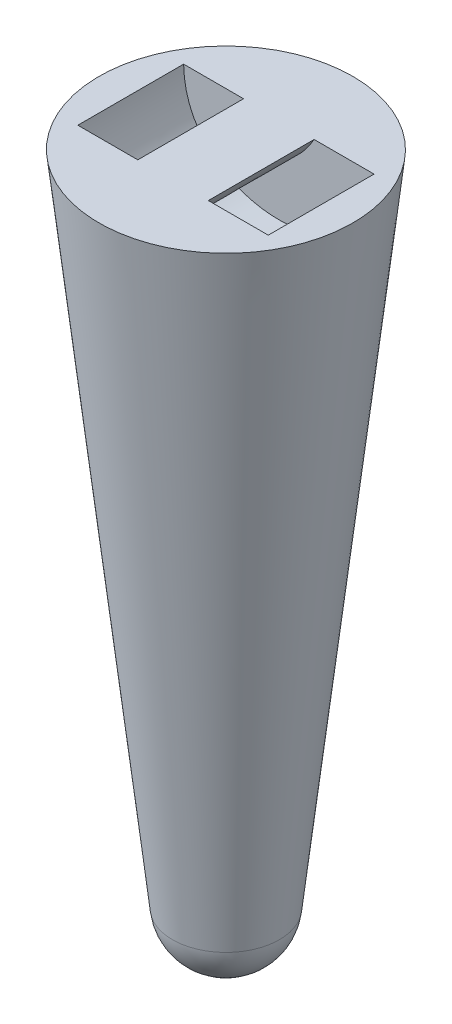
ISO-10303-21;
HEADER;
FILE_DESCRIPTION(('STEP AP214'),'2;1');
FILE_NAME('part.step','',(''),(''),'','','');
FILE_SCHEMA(('AUTOMOTIVE_DESIGN { 1 0 10303 214 1 1 1 1 }'));
ENDSEC;
DATA;
#1=APPLICATION_CONTEXT('core data for automotive mechanical design processes');
#2=APPLICATION_PROTOCOL_DEFINITION('international standard','automotive_design',2000,#1);
#3=PRODUCT_CONTEXT('',#1,'mechanical');
#4=PRODUCT('Part','Part','',(#3));
#5=PRODUCT_RELATED_PRODUCT_CATEGORY('part','',(#4));
#6=PRODUCT_DEFINITION_FORMATION('','',#4);
#7=PRODUCT_DEFINITION_CONTEXT('part definition',#1,'design');
#8=PRODUCT_DEFINITION('design','',#6,#7);
#9=PRODUCT_DEFINITION_SHAPE('','',#8);
#10=(LENGTH_UNIT() NAMED_UNIT(*) SI_UNIT(.MILLI.,.METRE.));
#11=(NAMED_UNIT(*) PLANE_ANGLE_UNIT() SI_UNIT($,.RADIAN.));
#12=(NAMED_UNIT(*) SI_UNIT($,.STERADIAN.) SOLID_ANGLE_UNIT());
#13=UNCERTAINTY_MEASURE_WITH_UNIT(LENGTH_MEASURE(1.E-05),#10,'distance_accuracy_value','');
#14=(GEOMETRIC_REPRESENTATION_CONTEXT(3) GLOBAL_UNCERTAINTY_ASSIGNED_CONTEXT((#13)) GLOBAL_UNIT_ASSIGNED_CONTEXT((#10,
#11,#12)) REPRESENTATION_CONTEXT('',''));
#15=CARTESIAN_POINT('',(0.,0.,0.));
#16=DIRECTION('',(0.,0.,1.));
#17=DIRECTION('',(1.,0.,0.));
#18=AXIS2_PLACEMENT_3D('',#15,#16,#17);
#19=CARTESIAN_POINT('',(-3.55464986802312E-06,107.977844344222,13.5));
#20=DIRECTION('',(0.,0.,-1.));
#21=DIRECTION('',(-1.,0.,0.));
#22=AXIS2_PLACEMENT_3D('',#19,#20,#21);
#23=PLANE('',#22);
#24=DIRECTION('',(-1.,0.,0.));
#25=VECTOR('',#24,1.);
#26=CARTESIAN_POINT('',(-24.3000035546499,130.224662195403,13.5));
#27=LINE('',#26,#25);
#28=CARTESIAN_POINT('',(-9.00000355464987,130.224662195403,13.5));
#29=VERTEX_POINT('',#28);
#30=CARTESIAN_POINT('',(-24.3000035546499,130.224662195403,13.5));
#31=VERTEX_POINT('',#30);
#32=EDGE_CURVE('E90',#29,#31,#27,.T.);
#33=ORIENTED_EDGE('',*,*,#32,.F.);
#34=CARTESIAN_POINT('',(-9.00000355464987,130.224662195403,13.5));
#35=CARTESIAN_POINT('',(-3.55464987085289E-06,114.921508275355,13.5));
#36=CARTESIAN_POINT('',(8.99999644535013,130.224662195403,13.5));
#37=B_SPLINE_CURVE_WITH_KNOTS('',2,(#34,#35,#36),.UNSPECIFIED.,.F.,.F.,(3,3),(0.,1.),.UNSPECIFIED.);
#38=CARTESIAN_POINT('',(8.99999644535013,130.224662195403,13.5));
#39=VERTEX_POINT('',#38);
#40=EDGE_CURVE('E80',#39,#29,#37,.F.);
#41=ORIENTED_EDGE('',*,*,#40,.F.);
#42=CARTESIAN_POINT('',(24.2999964453501,130.224662195403,13.5));
#43=VERTEX_POINT('',#42);
#44=EDGE_CURVE('E88',#43,#39,#27,.T.);
#45=ORIENTED_EDGE('',*,*,#44,.F.);
#46=CARTESIAN_POINT('',(-24.3000035546499,130.224662195403,13.5));
#47=CARTESIAN_POINT('',(-23.9240079280896,100.562238393829,13.5));
#48=CARTESIAN_POINT('',(23.9240008187898,100.562238393829,13.5));
#49=CARTESIAN_POINT('',(24.2999964453501,130.224662195403,13.5));
#50=B_SPLINE_CURVE_WITH_KNOTS('',3,(#46,#47,#48,#49),.UNSPECIFIED.,.F.,.F.,(4,4),(0.,1.),.UNSPECIFIED.);
#51=EDGE_CURVE('E100',#31,#43,#50,.T.);
#52=ORIENTED_EDGE('',*,*,#51,.F.);
#53=EDGE_LOOP('',(#33,#41,#45,#52));
#54=FACE_BOUND('',#53,.T.);
#55=ADVANCED_FACE('F36',(#54),#23,.T.);
#56=CARTESIAN_POINT('',(-3.55464986802312E-06,107.977844344222,-13.5));
#57=DIRECTION('',(0.,0.,-1.));
#58=DIRECTION('',(-1.,0.,0.));
#59=AXIS2_PLACEMENT_3D('',#56,#57,#58);
#60=PLANE('',#59);
#61=CARTESIAN_POINT('',(-9.00000355464987,130.224662195403,-13.5));
#62=CARTESIAN_POINT('',(-3.55464987085289E-06,114.921508275355,-13.5));
#63=CARTESIAN_POINT('',(8.99999644535013,130.224662195403,-13.5));
#64=B_SPLINE_CURVE_WITH_KNOTS('',2,(#61,#62,#63),.UNSPECIFIED.,.F.,.F.,(3,3),(0.,1.),.UNSPECIFIED.);
#65=CARTESIAN_POINT('',(-9.00000355464987,130.224662195403,-13.5));
#66=VERTEX_POINT('',#65);
#67=CARTESIAN_POINT('',(8.99999644535013,130.224662195403,-13.5));
#68=VERTEX_POINT('',#67);
#69=EDGE_CURVE('E82',#66,#68,#64,.T.);
#70=ORIENTED_EDGE('',*,*,#69,.F.);
#71=DIRECTION('',(-1.,0.,0.));
#72=VECTOR('',#71,1.);
#73=CARTESIAN_POINT('',(-24.3000035546499,130.224662195403,-13.5));
#74=LINE('',#73,#72);
#75=CARTESIAN_POINT('',(-24.3000035546499,130.224662195403,-13.5));
#76=VERTEX_POINT('',#75);
#77=EDGE_CURVE('E138',#66,#76,#74,.T.);
#78=ORIENTED_EDGE('',*,*,#77,.T.);
#79=CARTESIAN_POINT('',(-24.3000035546499,130.224662195403,-13.5));
#80=CARTESIAN_POINT('',(-23.9240079280896,100.562238393829,-13.5));
#81=CARTESIAN_POINT('',(23.9240008187898,100.562238393829,-13.5));
#82=CARTESIAN_POINT('',(24.2999964453501,130.224662195403,-13.5));
#83=B_SPLINE_CURVE_WITH_KNOTS('',3,(#79,#80,#81,#82),.UNSPECIFIED.,.F.,.F.,(4,4),(0.,1.),.UNSPECIFIED.);
#84=CARTESIAN_POINT('',(24.2999964453501,130.224662195403,-13.5));
#85=VERTEX_POINT('',#84);
#86=EDGE_CURVE('E137',#76,#85,#83,.T.);
#87=ORIENTED_EDGE('',*,*,#86,.T.);
#88=EDGE_CURVE('E59',#85,#68,#74,.T.);
#89=ORIENTED_EDGE('',*,*,#88,.T.);
#90=EDGE_LOOP('',(#70,#78,#87,#89));
#91=FACE_BOUND('',#90,.T.);
#92=ADVANCED_FACE('F113',(#91),#60,.F.);
#93=CARTESIAN_POINT('',(-3.55464986802312E-06,130.224662195403,0.));
#94=DIRECTION('',(0.,-1.,0.));
#95=DIRECTION('',(0.,0.,-1.));
#96=AXIS2_PLACEMENT_3D('',#93,#94,#95);
#97=PLANE('',#96);
#98=DIRECTION('',(0.,0.,-1.));
#99=VECTOR('',#98,1.);
#100=CARTESIAN_POINT('',(-9.00000355464987,130.224662195403,32.4036));
#101=LINE('',#100,#99);
#102=EDGE_CURVE('E51',#29,#66,#101,.T.);
#103=ORIENTED_EDGE('',*,*,#102,.F.);
#104=ORIENTED_EDGE('',*,*,#32,.T.);
#105=DIRECTION('',(0.,0.,-1.));
#106=VECTOR('',#105,1.);
#107=CARTESIAN_POINT('',(-24.3000035546499,130.224662195403,13.5));
#108=LINE('',#107,#106);
#109=EDGE_CURVE('E96',#31,#76,#108,.T.);
#110=ORIENTED_EDGE('',*,*,#109,.T.);
#111=ORIENTED_EDGE('',*,*,#77,.F.);
#112=EDGE_LOOP('',(#103,#104,#110,#111));
#113=FACE_BOUND('',#112,.T.);
#114=CARTESIAN_POINT('',(-3.55464986802312E-06,130.224662195403,0.));
#115=DIRECTION('',(0.,-1.,0.));
#116=DIRECTION('',(0.,0.,-1.));
#117=AXIS2_PLACEMENT_3D('',#114,#115,#116);
#118=CIRCLE('',#117,32.4);
#119=CARTESIAN_POINT('',(-3.55464986802312E-06,130.224662195403,-32.4));
#120=VERTEX_POINT('',#119);
#121=EDGE_CURVE('E44',#120,#120,#118,.T.);
#122=ORIENTED_EDGE('',*,*,#121,.F.);
#123=EDGE_LOOP('',(#122));
#124=FACE_BOUND('',#123,.T.);
#125=ORIENTED_EDGE('',*,*,#44,.T.);
#126=DIRECTION('',(0.,0.,-1.));
#127=VECTOR('',#126,1.);
#128=CARTESIAN_POINT('',(8.99999644535013,130.224662195403,32.4036));
#129=LINE('',#128,#127);
#130=EDGE_CURVE('E77',#39,#68,#129,.T.);
#131=ORIENTED_EDGE('',*,*,#130,.T.);
#132=ORIENTED_EDGE('',*,*,#88,.F.);
#133=DIRECTION('',(0.,0.,-1.));
#134=VECTOR('',#133,1.);
#135=CARTESIAN_POINT('',(24.2999964453501,130.224662195403,13.5));
#136=LINE('',#135,#134);
#137=EDGE_CURVE('E95',#43,#85,#136,.T.);
#138=ORIENTED_EDGE('',*,*,#137,.F.);
#139=EDGE_LOOP('',(#125,#131,#132,#138));
#140=FACE_BOUND('',#139,.T.);
#141=ADVANCED_FACE('F93',(#113,#124,#140),#97,.F.);
#142=CARTESIAN_POINT('',(-3.55464986802312E-06,-36.0229947796675,0.));
#143=DIRECTION('',(0.,-1.,0.));
#144=DIRECTION('',(-1.,0.,0.));
#145=AXIS2_PLACEMENT_3D('',#142,#143,#144);
#146=SPHERICAL_SURFACE('',#145,13.7523430249295);
#147=CARTESIAN_POINT('',(-3.55464986802312E-06,-37.5490149027572,0.));
#148=DIRECTION('',(0.,-1.,0.));
#149=DIRECTION('',(0.,0.,-1.));
#150=AXIS2_PLACEMENT_3D('',#147,#148,#149);
#151=CIRCLE('',#150,13.6674138467836);
#152=CARTESIAN_POINT('',(-3.55464986802312E-06,-37.5490149027572,-13.6674138467836));
#153=VERTEX_POINT('',#152);
#154=EDGE_CURVE('E11',#153,#153,#151,.T.);
#155=ORIENTED_EDGE('',*,*,#154,.T.);
#156=EDGE_LOOP('',(#155));
#157=FACE_BOUND('',#156,.T.);
#158=ADVANCED_FACE('F38',(#157),#146,.T.);
#159=CARTESIAN_POINT('',(-3.55464986802312E-06,130.224662195403,0.));
#160=DIRECTION('',(0.,1.,0.));
#161=DIRECTION('',(0.,0.,1.));
#162=AXIS2_PLACEMENT_3D('',#159,#160,#161);
#163=CONICAL_SURFACE('',#162,32.4,0.111193363332835);
#164=ORIENTED_EDGE('',*,*,#154,.F.);
#165=EDGE_LOOP('',(#164));
#166=FACE_BOUND('',#165,.T.);
#167=ORIENTED_EDGE('',*,*,#121,.T.);
#168=EDGE_LOOP('',(#167));
#169=FACE_BOUND('',#168,.T.);
#170=ADVANCED_FACE('F110',(#166,#169),#163,.T.);
#171=DIRECTION('',(0.,0.,-1.));
#172=VECTOR('',#171,1.);
#173=SURFACE_OF_LINEAR_EXTRUSION('',#50,#172);
#174=ORIENTED_EDGE('',*,*,#109,.F.);
#175=ORIENTED_EDGE('',*,*,#51,.T.);
#176=ORIENTED_EDGE('',*,*,#137,.T.);
#177=ORIENTED_EDGE('',*,*,#86,.F.);
#178=EDGE_LOOP('',(#174,#175,#176,#177));
#179=FACE_BOUND('',#178,.T.);
#180=ADVANCED_FACE('F127',(#179),#173,.T.);
#181=CARTESIAN_POINT('',(-9.00000355464987,130.224662195403,32.4036));
#182=CARTESIAN_POINT('',(-3.55464987085289E-06,114.921508275355,32.4036));
#183=CARTESIAN_POINT('',(8.99999644535013,130.224662195403,32.4036));
#184=B_SPLINE_CURVE_WITH_KNOTS('',2,(#181,#182,#183),.UNSPECIFIED.,.F.,.F.,(3,3),(0.,1.),.UNSPECIFIED.);
#185=DIRECTION('',(0.,0.,-1.));
#186=VECTOR('',#185,1.);
#187=SURFACE_OF_LINEAR_EXTRUSION('',#184,#186);
#188=ORIENTED_EDGE('',*,*,#130,.F.);
#189=ORIENTED_EDGE('',*,*,#40,.T.);
#190=ORIENTED_EDGE('',*,*,#102,.T.);
#191=ORIENTED_EDGE('',*,*,#69,.T.);
#192=EDGE_LOOP('',(#188,#189,#190,#191));
#193=FACE_BOUND('',#192,.T.);
#194=ADVANCED_FACE('F79',(#193),#187,.F.);
#195=CLOSED_SHELL('',(#55,#92,#141,#158,#170,#180,#194));
#196=MANIFOLD_SOLID_BREP('B2',#195);
#197=ADVANCED_BREP_SHAPE_REPRESENTATION('',(#18,#196),#14);
#198=SHAPE_DEFINITION_REPRESENTATION(#9,#197);
ENDSEC;
END-ISO-10303-21;
